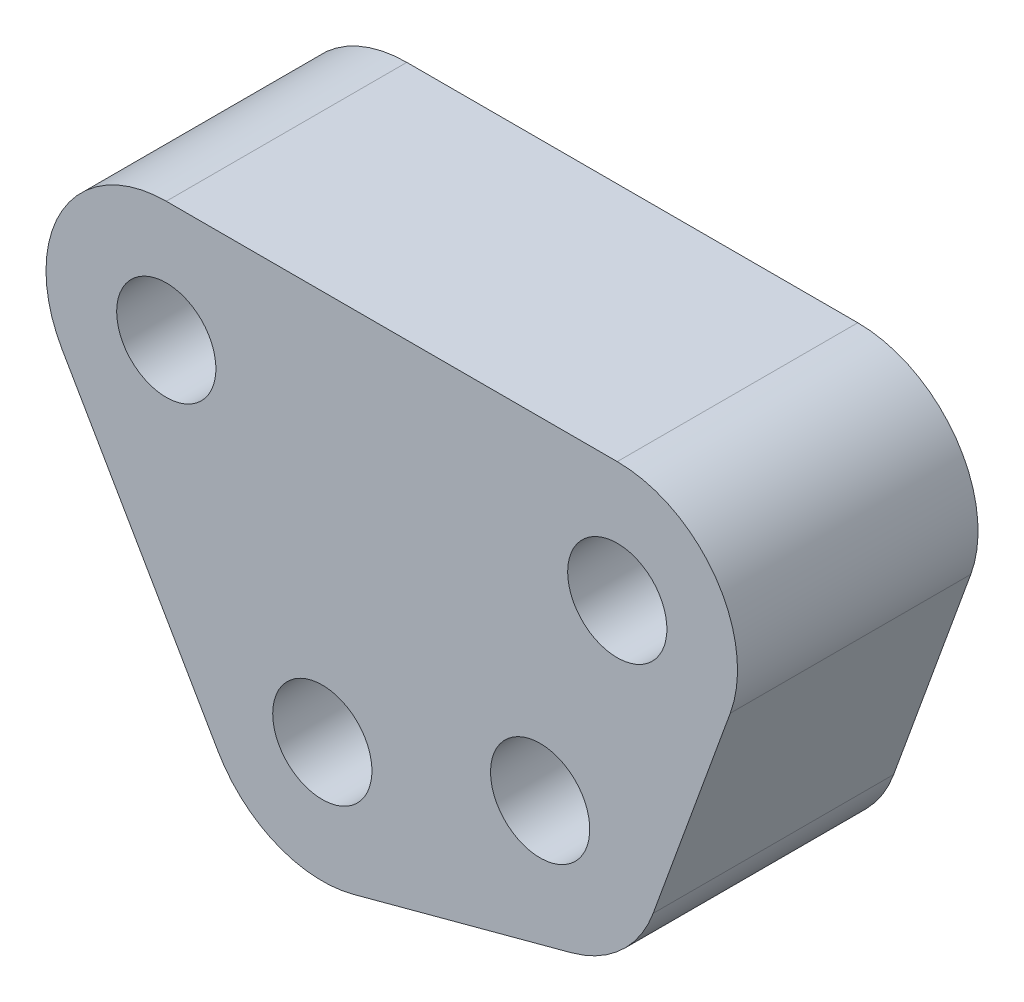
ISO-10303-21;
HEADER;
FILE_DESCRIPTION(('STEP AP214'),'2;1');
FILE_NAME('part.step','',(''),(''),'','','');
FILE_SCHEMA(('AUTOMOTIVE_DESIGN { 1 0 10303 214 1 1 1 1 }'));
ENDSEC;
DATA;
#1=APPLICATION_CONTEXT('core data for automotive mechanical design processes');
#2=APPLICATION_PROTOCOL_DEFINITION('international standard','automotive_design',2000,#1);
#3=PRODUCT_CONTEXT('',#1,'mechanical');
#4=PRODUCT('Part','Part','',(#3));
#5=PRODUCT_RELATED_PRODUCT_CATEGORY('part','',(#4));
#6=PRODUCT_DEFINITION_FORMATION('','',#4);
#7=PRODUCT_DEFINITION_CONTEXT('part definition',#1,'design');
#8=PRODUCT_DEFINITION('design','',#6,#7);
#9=PRODUCT_DEFINITION_SHAPE('','',#8);
#10=(LENGTH_UNIT() NAMED_UNIT(*) SI_UNIT(.MILLI.,.METRE.));
#11=(NAMED_UNIT(*) PLANE_ANGLE_UNIT() SI_UNIT($,.RADIAN.));
#12=(NAMED_UNIT(*) SI_UNIT($,.STERADIAN.) SOLID_ANGLE_UNIT());
#13=UNCERTAINTY_MEASURE_WITH_UNIT(LENGTH_MEASURE(1.E-05),#10,'distance_accuracy_value','');
#14=(GEOMETRIC_REPRESENTATION_CONTEXT(3) GLOBAL_UNCERTAINTY_ASSIGNED_CONTEXT((#13)) GLOBAL_UNIT_ASSIGNED_CONTEXT((#10,
#11,#12)) REPRESENTATION_CONTEXT('',''));
#15=CARTESIAN_POINT('',(0.,0.,0.));
#16=DIRECTION('',(0.,0.,1.));
#17=DIRECTION('',(1.,0.,0.));
#18=AXIS2_PLACEMENT_3D('',#15,#16,#17);
#19=CARTESIAN_POINT('',(-15.,0.,0.));
#20=DIRECTION('',(0.,0.,1.));
#21=DIRECTION('',(1.,0.,0.));
#22=AXIS2_PLACEMENT_3D('',#19,#20,#21);
#23=PLANE('',#22);
#24=CARTESIAN_POINT('',(-15.,0.,0.));
#25=DIRECTION('',(0.,0.,-1.));
#26=DIRECTION('',(-1.,0.,0.));
#27=AXIS2_PLACEMENT_3D('',#24,#25,#26);
#28=CIRCLE('',#27,1.64999999999999);
#29=CARTESIAN_POINT('',(-16.65,0.,0.));
#30=VERTEX_POINT('',#29);
#31=EDGE_CURVE('E202',#30,#30,#28,.T.);
#32=ORIENTED_EDGE('',*,*,#31,.F.);
#33=EDGE_LOOP('',(#32));
#34=FACE_BOUND('',#33,.T.);
#35=CARTESIAN_POINT('',(0.,0.,0.));
#36=DIRECTION('',(0.,0.,-1.));
#37=DIRECTION('',(-1.,0.,0.));
#38=AXIS2_PLACEMENT_3D('',#35,#36,#37);
#39=CIRCLE('',#38,1.64999999999999);
#40=CARTESIAN_POINT('',(-1.64999999999999,0.,0.));
#41=VERTEX_POINT('',#40);
#42=EDGE_CURVE('E196',#41,#41,#39,.T.);
#43=ORIENTED_EDGE('',*,*,#42,.F.);
#44=EDGE_LOOP('',(#43));
#45=FACE_BOUND('',#44,.T.);
#46=CARTESIAN_POINT('',(-2.56515107494255,-7.0476946558943,0.));
#47=DIRECTION('',(0.,0.,-1.));
#48=DIRECTION('',(-1.,0.,0.));
#49=AXIS2_PLACEMENT_3D('',#46,#47,#48);
#50=CIRCLE('',#49,1.64999999999999);
#51=CARTESIAN_POINT('',(-4.21515107494253,-7.0476946558943,0.));
#52=VERTEX_POINT('',#51);
#53=EDGE_CURVE('E190',#52,#52,#50,.T.);
#54=ORIENTED_EDGE('',*,*,#53,.F.);
#55=EDGE_LOOP('',(#54));
#56=FACE_BOUND('',#55,.T.);
#57=CARTESIAN_POINT('',(-15.,0.,0.));
#58=DIRECTION('',(0.,0.,1.));
#59=DIRECTION('',(1.,0.,0.));
#60=AXIS2_PLACEMENT_3D('',#57,#58,#59);
#61=CIRCLE('',#60,4.);
#62=CARTESIAN_POINT('',(-15.,4.,0.));
#63=VERTEX_POINT('',#62);
#64=CARTESIAN_POINT('',(-18.4641016151378,-1.99999999999999,0.));
#65=VERTEX_POINT('',#64);
#66=EDGE_CURVE('E134',#63,#65,#61,.T.);
#67=ORIENTED_EDGE('',*,*,#66,.F.);
#68=DIRECTION('',(-1.,0.,0.));
#69=VECTOR('',#68,1.);
#70=CARTESIAN_POINT('',(-15.,4.,0.));
#71=LINE('',#70,#69);
#72=CARTESIAN_POINT('',(0.,4.,0.));
#73=VERTEX_POINT('',#72);
#74=EDGE_CURVE('E89',#73,#63,#71,.T.);
#75=ORIENTED_EDGE('',*,*,#74,.F.);
#76=CARTESIAN_POINT('',(0.,0.,0.));
#77=DIRECTION('',(0.,0.,1.));
#78=DIRECTION('',(-1.,0.,0.));
#79=AXIS2_PLACEMENT_3D('',#76,#77,#78);
#80=CIRCLE('',#79,4.);
#81=CARTESIAN_POINT('',(3.75877048314363,-1.36808057330269,0.));
#82=VERTEX_POINT('',#81);
#83=EDGE_CURVE('E83',#82,#73,#80,.T.);
#84=ORIENTED_EDGE('',*,*,#83,.F.);
#85=DIRECTION('',(0.342020143325673,0.939692620785907,0.));
#86=VECTOR('',#85,1.);
#87=CARTESIAN_POINT('',(3.75877048314363,-1.36808057330269,0.));
#88=LINE('',#87,#86);
#89=CARTESIAN_POINT('',(1.19361940820108,-8.41577522919699,0.));
#90=VERTEX_POINT('',#89);
#91=EDGE_CURVE('E124',#90,#82,#88,.T.);
#92=ORIENTED_EDGE('',*,*,#91,.F.);
#93=CARTESIAN_POINT('',(-2.56515107494255,-7.0476946558943,0.));
#94=DIRECTION('',(0.,0.,1.));
#95=DIRECTION('',(-1.,0.,0.));
#96=AXIS2_PLACEMENT_3D('',#93,#94,#95);
#97=CIRCLE('',#96,4.);
#98=CARTESIAN_POINT('',(-1.52987489453246,-10.9113979610506,0.));
#99=VERTEX_POINT('',#98);
#100=EDGE_CURVE('E144',#99,#90,#97,.T.);
#101=ORIENTED_EDGE('',*,*,#100,.F.);
#102=DIRECTION('',(0.965925826289068,0.258819045102521,0.));
#103=VECTOR('',#102,1.);
#104=CARTESIAN_POINT('',(-8.7749226279067,-12.8527026503331,0.));
#105=LINE('',#104,#103);
#106=CARTESIAN_POINT('',(-8.7749226279067,-12.8527026503331,0.));
#107=VERTEX_POINT('',#106);
#108=EDGE_CURVE('E142',#107,#99,#105,.T.);
#109=ORIENTED_EDGE('',*,*,#108,.F.);
#110=CARTESIAN_POINT('',(-9.81019880831679,-8.98899934517687,0.));
#111=DIRECTION('',(0.,0.,1.));
#112=DIRECTION('',(1.,0.,0.));
#113=AXIS2_PLACEMENT_3D('',#110,#111,#112);
#114=CIRCLE('',#113,4.);
#115=CARTESIAN_POINT('',(-13.2743004234545,-10.9889993451769,0.));
#116=VERTEX_POINT('',#115);
#117=EDGE_CURVE('E140',#116,#107,#114,.T.);
#118=ORIENTED_EDGE('',*,*,#117,.F.);
#119=DIRECTION('',(0.499999999999998,-0.86602540378444,0.));
#120=VECTOR('',#119,1.);
#121=CARTESIAN_POINT('',(-18.4641016151378,-1.99999999999999,0.));
#122=LINE('',#121,#120);
#123=EDGE_CURVE('E137',#65,#116,#122,.T.);
#124=ORIENTED_EDGE('',*,*,#123,.F.);
#125=EDGE_LOOP('',(#67,#75,#84,#92,#101,#109,#118,#124));
#126=FACE_BOUND('',#125,.T.);
#127=CARTESIAN_POINT('',(-9.81019880831679,-8.98899934517687,0.));
#128=DIRECTION('',(0.,0.,-1.));
#129=DIRECTION('',(-1.,0.,0.));
#130=AXIS2_PLACEMENT_3D('',#127,#128,#129);
#131=CIRCLE('',#130,1.64999999999999);
#132=CARTESIAN_POINT('',(-11.4601988083168,-8.98899934517687,0.));
#133=VERTEX_POINT('',#132);
#134=EDGE_CURVE('E184',#133,#133,#131,.T.);
#135=ORIENTED_EDGE('',*,*,#134,.F.);
#136=EDGE_LOOP('',(#135));
#137=FACE_BOUND('',#136,.T.);
#138=ADVANCED_FACE('F37',(#34,#45,#56,#126,#137),#23,.F.);
#139=CARTESIAN_POINT('',(-15.,0.,8.));
#140=DIRECTION('',(0.,0.,-1.));
#141=DIRECTION('',(-1.,0.,0.));
#142=AXIS2_PLACEMENT_3D('',#139,#140,#141);
#143=CYLINDRICAL_SURFACE('',#142,4.);
#144=ORIENTED_EDGE('',*,*,#66,.T.);
#145=DIRECTION('',(0.,0.,-1.));
#146=VECTOR('',#145,1.);
#147=CARTESIAN_POINT('',(-18.4641016151378,-1.99999999999999,8.));
#148=LINE('',#147,#146);
#149=CARTESIAN_POINT('',(-18.4641016151378,-1.99999999999999,8.));
#150=VERTEX_POINT('',#149);
#151=EDGE_CURVE('E11',#150,#65,#148,.T.);
#152=ORIENTED_EDGE('',*,*,#151,.F.);
#153=CARTESIAN_POINT('',(-15.,0.,8.));
#154=DIRECTION('',(0.,0.,1.));
#155=DIRECTION('',(1.,0.,0.));
#156=AXIS2_PLACEMENT_3D('',#153,#154,#155);
#157=CIRCLE('',#156,4.);
#158=CARTESIAN_POINT('',(-15.,4.,8.));
#159=VERTEX_POINT('',#158);
#160=EDGE_CURVE('E149',#159,#150,#157,.T.);
#161=ORIENTED_EDGE('',*,*,#160,.F.);
#162=DIRECTION('',(0.,0.,-1.));
#163=VECTOR('',#162,1.);
#164=CARTESIAN_POINT('',(-15.,4.,8.));
#165=LINE('',#164,#163);
#166=EDGE_CURVE('E130',#159,#63,#165,.T.);
#167=ORIENTED_EDGE('',*,*,#166,.T.);
#168=EDGE_LOOP('',(#144,#152,#161,#167));
#169=FACE_BOUND('',#168,.T.);
#170=ADVANCED_FACE('F39',(#169),#143,.T.);
#171=CARTESIAN_POINT('',(-18.4641016151378,-1.99999999999999,8.));
#172=DIRECTION('',(0.86602540378444,0.499999999999998,0.));
#173=DIRECTION('',(-0.499999999999998,0.86602540378444,0.));
#174=AXIS2_PLACEMENT_3D('',#171,#172,#173);
#175=PLANE('',#174);
#176=ORIENTED_EDGE('',*,*,#123,.T.);
#177=DIRECTION('',(0.,0.,-1.));
#178=VECTOR('',#177,1.);
#179=CARTESIAN_POINT('',(-13.2743004234545,-10.9889993451769,8.));
#180=LINE('',#179,#178);
#181=CARTESIAN_POINT('',(-13.2743004234545,-10.9889993451769,8.));
#182=VERTEX_POINT('',#181);
#183=EDGE_CURVE('E46',#182,#116,#180,.T.);
#184=ORIENTED_EDGE('',*,*,#183,.F.);
#185=DIRECTION('',(0.499999999999998,-0.86602540378444,0.));
#186=VECTOR('',#185,1.);
#187=CARTESIAN_POINT('',(-18.4641016151378,-1.99999999999999,8.));
#188=LINE('',#187,#186);
#189=EDGE_CURVE('E97',#150,#182,#188,.T.);
#190=ORIENTED_EDGE('',*,*,#189,.F.);
#191=ORIENTED_EDGE('',*,*,#151,.T.);
#192=EDGE_LOOP('',(#176,#184,#190,#191));
#193=FACE_BOUND('',#192,.T.);
#194=ADVANCED_FACE('F247',(#193),#175,.F.);
#195=CARTESIAN_POINT('',(-9.81019880831679,-8.98899934517687,8.));
#196=DIRECTION('',(0.,0.,-1.));
#197=DIRECTION('',(-1.,0.,0.));
#198=AXIS2_PLACEMENT_3D('',#195,#196,#197);
#199=CYLINDRICAL_SURFACE('',#198,4.);
#200=ORIENTED_EDGE('',*,*,#117,.T.);
#201=DIRECTION('',(0.,0.,-1.));
#202=VECTOR('',#201,1.);
#203=CARTESIAN_POINT('',(-8.7749226279067,-12.8527026503331,8.));
#204=LINE('',#203,#202);
#205=CARTESIAN_POINT('',(-8.7749226279067,-12.8527026503331,8.));
#206=VERTEX_POINT('',#205);
#207=EDGE_CURVE('E156',#206,#107,#204,.T.);
#208=ORIENTED_EDGE('',*,*,#207,.F.);
#209=CARTESIAN_POINT('',(-9.81019880831679,-8.98899934517687,8.));
#210=DIRECTION('',(0.,0.,1.));
#211=DIRECTION('',(1.,0.,0.));
#212=AXIS2_PLACEMENT_3D('',#209,#210,#211);
#213=CIRCLE('',#212,4.);
#214=EDGE_CURVE('E164',#182,#206,#213,.T.);
#215=ORIENTED_EDGE('',*,*,#214,.F.);
#216=ORIENTED_EDGE('',*,*,#183,.T.);
#217=EDGE_LOOP('',(#200,#208,#215,#216));
#218=FACE_BOUND('',#217,.T.);
#219=ADVANCED_FACE('F162',(#218),#199,.T.);
#220=CARTESIAN_POINT('',(-8.7749226279067,-12.8527026503331,8.));
#221=DIRECTION('',(-0.258819045102521,0.965925826289068,0.));
#222=DIRECTION('',(-0.965925826289068,-0.258819045102521,0.));
#223=AXIS2_PLACEMENT_3D('',#220,#221,#222);
#224=PLANE('',#223);
#225=ORIENTED_EDGE('',*,*,#108,.T.);
#226=DIRECTION('',(0.,0.,-1.));
#227=VECTOR('',#226,1.);
#228=CARTESIAN_POINT('',(-1.52987489453246,-10.9113979610506,8.));
#229=LINE('',#228,#227);
#230=CARTESIAN_POINT('',(-1.52987489453246,-10.9113979610506,8.));
#231=VERTEX_POINT('',#230);
#232=EDGE_CURVE('E153',#231,#99,#229,.T.);
#233=ORIENTED_EDGE('',*,*,#232,.F.);
#234=DIRECTION('',(0.965925826289068,0.258819045102521,0.));
#235=VECTOR('',#234,1.);
#236=CARTESIAN_POINT('',(-8.7749226279067,-12.8527026503331,8.));
#237=LINE('',#236,#235);
#238=EDGE_CURVE('E176',#206,#231,#237,.T.);
#239=ORIENTED_EDGE('',*,*,#238,.F.);
#240=ORIENTED_EDGE('',*,*,#207,.T.);
#241=EDGE_LOOP('',(#225,#233,#239,#240));
#242=FACE_BOUND('',#241,.T.);
#243=ADVANCED_FACE('F172',(#242),#224,.F.);
#244=CARTESIAN_POINT('',(-2.56515107494255,-7.0476946558943,8.));
#245=DIRECTION('',(0.,0.,-1.));
#246=DIRECTION('',(-1.,0.,0.));
#247=AXIS2_PLACEMENT_3D('',#244,#245,#246);
#248=CYLINDRICAL_SURFACE('',#247,4.);
#249=ORIENTED_EDGE('',*,*,#100,.T.);
#250=DIRECTION('',(0.,0.,-1.));
#251=VECTOR('',#250,1.);
#252=CARTESIAN_POINT('',(1.19361940820108,-8.41577522919699,8.));
#253=LINE('',#252,#251);
#254=CARTESIAN_POINT('',(1.19361940820108,-8.41577522919699,8.));
#255=VERTEX_POINT('',#254);
#256=EDGE_CURVE('E125',#255,#90,#253,.T.);
#257=ORIENTED_EDGE('',*,*,#256,.F.);
#258=CARTESIAN_POINT('',(-2.56515107494255,-7.0476946558943,8.));
#259=DIRECTION('',(0.,0.,1.));
#260=DIRECTION('',(-1.,0.,0.));
#261=AXIS2_PLACEMENT_3D('',#258,#259,#260);
#262=CIRCLE('',#261,4.);
#263=EDGE_CURVE('E116',#231,#255,#262,.T.);
#264=ORIENTED_EDGE('',*,*,#263,.F.);
#265=ORIENTED_EDGE('',*,*,#232,.T.);
#266=EDGE_LOOP('',(#249,#257,#264,#265));
#267=FACE_BOUND('',#266,.T.);
#268=ADVANCED_FACE('F175',(#267),#248,.T.);
#269=CARTESIAN_POINT('',(3.75877048314363,-1.36808057330269,8.));
#270=DIRECTION('',(-0.939692620785907,0.342020143325673,0.));
#271=DIRECTION('',(-0.342020143325673,-0.939692620785907,0.));
#272=AXIS2_PLACEMENT_3D('',#269,#270,#271);
#273=PLANE('',#272);
#274=ORIENTED_EDGE('',*,*,#91,.T.);
#275=DIRECTION('',(0.,0.,-1.));
#276=VECTOR('',#275,1.);
#277=CARTESIAN_POINT('',(3.75877048314363,-1.36808057330269,8.));
#278=LINE('',#277,#276);
#279=CARTESIAN_POINT('',(3.75877048314363,-1.36808057330269,8.));
#280=VERTEX_POINT('',#279);
#281=EDGE_CURVE('E121',#280,#82,#278,.T.);
#282=ORIENTED_EDGE('',*,*,#281,.F.);
#283=DIRECTION('',(0.342020143325673,0.939692620785907,0.));
#284=VECTOR('',#283,1.);
#285=CARTESIAN_POINT('',(3.75877048314363,-1.36808057330269,8.));
#286=LINE('',#285,#284);
#287=EDGE_CURVE('E110',#255,#280,#286,.T.);
#288=ORIENTED_EDGE('',*,*,#287,.F.);
#289=ORIENTED_EDGE('',*,*,#256,.T.);
#290=EDGE_LOOP('',(#274,#282,#288,#289));
#291=FACE_BOUND('',#290,.T.);
#292=ADVANCED_FACE('F122',(#291),#273,.F.);
#293=CARTESIAN_POINT('',(0.,0.,8.));
#294=DIRECTION('',(0.,0.,-1.));
#295=DIRECTION('',(-1.,0.,0.));
#296=AXIS2_PLACEMENT_3D('',#293,#294,#295);
#297=CYLINDRICAL_SURFACE('',#296,4.);
#298=ORIENTED_EDGE('',*,*,#83,.T.);
#299=DIRECTION('',(0.,0.,-1.));
#300=VECTOR('',#299,1.);
#301=CARTESIAN_POINT('',(0.,4.,8.));
#302=LINE('',#301,#300);
#303=CARTESIAN_POINT('',(0.,4.,8.));
#304=VERTEX_POINT('',#303);
#305=EDGE_CURVE('E126',#304,#73,#302,.T.);
#306=ORIENTED_EDGE('',*,*,#305,.F.);
#307=CARTESIAN_POINT('',(0.,0.,8.));
#308=DIRECTION('',(0.,0.,1.));
#309=DIRECTION('',(-1.,0.,0.));
#310=AXIS2_PLACEMENT_3D('',#307,#308,#309);
#311=CIRCLE('',#310,4.);
#312=EDGE_CURVE('E114',#280,#304,#311,.T.);
#313=ORIENTED_EDGE('',*,*,#312,.F.);
#314=ORIENTED_EDGE('',*,*,#281,.T.);
#315=EDGE_LOOP('',(#298,#306,#313,#314));
#316=FACE_BOUND('',#315,.T.);
#317=ADVANCED_FACE('F128',(#316),#297,.T.);
#318=CARTESIAN_POINT('',(-15.,4.,8.));
#319=DIRECTION('',(0.,-1.,0.));
#320=DIRECTION('',(0.,0.,-1.));
#321=AXIS2_PLACEMENT_3D('',#318,#319,#320);
#322=PLANE('',#321);
#323=ORIENTED_EDGE('',*,*,#74,.T.);
#324=ORIENTED_EDGE('',*,*,#166,.F.);
#325=DIRECTION('',(-1.,0.,0.));
#326=VECTOR('',#325,1.);
#327=CARTESIAN_POINT('',(-15.,4.,8.));
#328=LINE('',#327,#326);
#329=EDGE_CURVE('E54',#304,#159,#328,.T.);
#330=ORIENTED_EDGE('',*,*,#329,.F.);
#331=ORIENTED_EDGE('',*,*,#305,.T.);
#332=EDGE_LOOP('',(#323,#324,#330,#331));
#333=FACE_BOUND('',#332,.T.);
#334=ADVANCED_FACE('F233',(#333),#322,.F.);
#335=CARTESIAN_POINT('',(-15.,0.,8.));
#336=DIRECTION('',(0.,0.,1.));
#337=DIRECTION('',(1.,0.,0.));
#338=AXIS2_PLACEMENT_3D('',#335,#336,#337);
#339=PLANE('',#338);
#340=CARTESIAN_POINT('',(-15.,0.,8.));
#341=DIRECTION('',(0.,0.,-1.));
#342=DIRECTION('',(-1.,0.,0.));
#343=AXIS2_PLACEMENT_3D('',#340,#341,#342);
#344=CIRCLE('',#343,1.65);
#345=CARTESIAN_POINT('',(-16.65,0.,8.));
#346=VERTEX_POINT('',#345);
#347=EDGE_CURVE('E199',#346,#346,#344,.T.);
#348=ORIENTED_EDGE('',*,*,#347,.T.);
#349=EDGE_LOOP('',(#348));
#350=FACE_BOUND('',#349,.T.);
#351=CARTESIAN_POINT('',(0.,0.,8.));
#352=DIRECTION('',(0.,0.,-1.));
#353=DIRECTION('',(-1.,0.,0.));
#354=AXIS2_PLACEMENT_3D('',#351,#352,#353);
#355=CIRCLE('',#354,1.65);
#356=CARTESIAN_POINT('',(-1.65,0.,8.));
#357=VERTEX_POINT('',#356);
#358=EDGE_CURVE('E193',#357,#357,#355,.T.);
#359=ORIENTED_EDGE('',*,*,#358,.T.);
#360=EDGE_LOOP('',(#359));
#361=FACE_BOUND('',#360,.T.);
#362=CARTESIAN_POINT('',(-2.56515107494255,-7.0476946558943,8.));
#363=DIRECTION('',(0.,0.,-1.));
#364=DIRECTION('',(-1.,0.,0.));
#365=AXIS2_PLACEMENT_3D('',#362,#363,#364);
#366=CIRCLE('',#365,1.65);
#367=CARTESIAN_POINT('',(-4.21515107494254,-7.0476946558943,8.));
#368=VERTEX_POINT('',#367);
#369=EDGE_CURVE('E187',#368,#368,#366,.T.);
#370=ORIENTED_EDGE('',*,*,#369,.T.);
#371=EDGE_LOOP('',(#370));
#372=FACE_BOUND('',#371,.T.);
#373=CARTESIAN_POINT('',(-9.81019880831679,-8.98899934517687,8.));
#374=DIRECTION('',(0.,0.,-1.));
#375=DIRECTION('',(-1.,0.,0.));
#376=AXIS2_PLACEMENT_3D('',#373,#374,#375);
#377=CIRCLE('',#376,1.65);
#378=CARTESIAN_POINT('',(-11.4601988083168,-8.98899934517687,8.));
#379=VERTEX_POINT('',#378);
#380=EDGE_CURVE('E138',#379,#379,#377,.T.);
#381=ORIENTED_EDGE('',*,*,#380,.T.);
#382=EDGE_LOOP('',(#381));
#383=FACE_BOUND('',#382,.T.);
#384=ORIENTED_EDGE('',*,*,#160,.T.);
#385=ORIENTED_EDGE('',*,*,#189,.T.);
#386=ORIENTED_EDGE('',*,*,#214,.T.);
#387=ORIENTED_EDGE('',*,*,#238,.T.);
#388=ORIENTED_EDGE('',*,*,#263,.T.);
#389=ORIENTED_EDGE('',*,*,#287,.T.);
#390=ORIENTED_EDGE('',*,*,#312,.T.);
#391=ORIENTED_EDGE('',*,*,#329,.T.);
#392=EDGE_LOOP('',(#384,#385,#386,#387,#388,#389,#390,#391));
#393=FACE_BOUND('',#392,.T.);
#394=ADVANCED_FACE('F112',(#350,#361,#372,#383,#393),#339,.T.);
#395=CARTESIAN_POINT('',(-9.81019880831679,-8.98899934517687,0.));
#396=DIRECTION('',(0.,0.,-1.));
#397=DIRECTION('',(-1.,0.,0.));
#398=AXIS2_PLACEMENT_3D('',#395,#396,#397);
#399=CYLINDRICAL_SURFACE('',#398,1.64999999999999);
#400=ORIENTED_EDGE('',*,*,#380,.F.);
#401=EDGE_LOOP('',(#400));
#402=FACE_BOUND('',#401,.T.);
#403=ORIENTED_EDGE('',*,*,#134,.T.);
#404=EDGE_LOOP('',(#403));
#405=FACE_BOUND('',#404,.T.);
#406=ADVANCED_FACE('F218',(#402,#405),#399,.F.);
#407=CARTESIAN_POINT('',(-2.56515107494255,-7.0476946558943,0.));
#408=DIRECTION('',(0.,0.,-1.));
#409=DIRECTION('',(-1.,0.,0.));
#410=AXIS2_PLACEMENT_3D('',#407,#408,#409);
#411=CYLINDRICAL_SURFACE('',#410,1.64999999999999);
#412=ORIENTED_EDGE('',*,*,#369,.F.);
#413=EDGE_LOOP('',(#412));
#414=FACE_BOUND('',#413,.T.);
#415=ORIENTED_EDGE('',*,*,#53,.T.);
#416=EDGE_LOOP('',(#415));
#417=FACE_BOUND('',#416,.T.);
#418=ADVANCED_FACE('F215',(#414,#417),#411,.F.);
#419=CARTESIAN_POINT('',(0.,0.,0.));
#420=DIRECTION('',(0.,0.,-1.));
#421=DIRECTION('',(-1.,0.,0.));
#422=AXIS2_PLACEMENT_3D('',#419,#420,#421);
#423=CYLINDRICAL_SURFACE('',#422,1.64999999999999);
#424=ORIENTED_EDGE('',*,*,#358,.F.);
#425=EDGE_LOOP('',(#424));
#426=FACE_BOUND('',#425,.T.);
#427=ORIENTED_EDGE('',*,*,#42,.T.);
#428=EDGE_LOOP('',(#427));
#429=FACE_BOUND('',#428,.T.);
#430=ADVANCED_FACE('F217',(#426,#429),#423,.F.);
#431=CARTESIAN_POINT('',(-15.,0.,0.));
#432=DIRECTION('',(0.,0.,-1.));
#433=DIRECTION('',(-1.,0.,0.));
#434=AXIS2_PLACEMENT_3D('',#431,#432,#433);
#435=CYLINDRICAL_SURFACE('',#434,1.64999999999999);
#436=ORIENTED_EDGE('',*,*,#347,.F.);
#437=EDGE_LOOP('',(#436));
#438=FACE_BOUND('',#437,.T.);
#439=ORIENTED_EDGE('',*,*,#31,.T.);
#440=EDGE_LOOP('',(#439));
#441=FACE_BOUND('',#440,.T.);
#442=ADVANCED_FACE('F206',(#438,#441),#435,.F.);
#443=CLOSED_SHELL('',(#138,#170,#194,#219,#243,#268,#292,#317,#334,#394,#406,#418,#430,#442));
#444=MANIFOLD_SOLID_BREP('B2',#443);
#445=ADVANCED_BREP_SHAPE_REPRESENTATION('',(#18,#444),#14);
#446=SHAPE_DEFINITION_REPRESENTATION(#9,#445);
ENDSEC;
END-ISO-10303-21;
